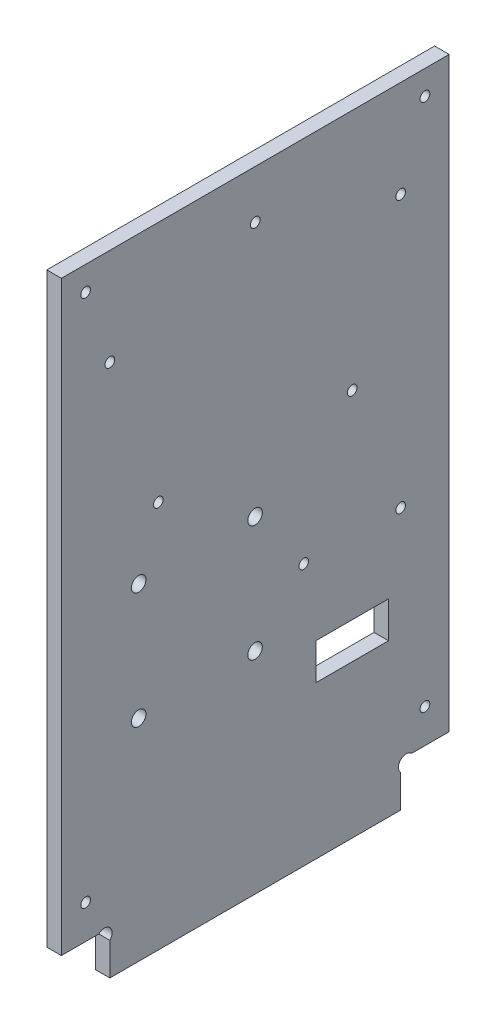
ISO-10303-21;
HEADER;
FILE_DESCRIPTION(('STEP AP214'),'2;1');
FILE_NAME('part.step','',(''),(''),'','','');
FILE_SCHEMA(('AUTOMOTIVE_DESIGN { 1 0 10303 214 1 1 1 1 }'));
ENDSEC;
DATA;
#1=APPLICATION_CONTEXT('core data for automotive mechanical design processes');
#2=APPLICATION_PROTOCOL_DEFINITION('international standard','automotive_design',2000,#1);
#3=PRODUCT_CONTEXT('',#1,'mechanical');
#4=PRODUCT('Part','Part','',(#3));
#5=PRODUCT_RELATED_PRODUCT_CATEGORY('part','',(#4));
#6=PRODUCT_DEFINITION_FORMATION('','',#4);
#7=PRODUCT_DEFINITION_CONTEXT('part definition',#1,'design');
#8=PRODUCT_DEFINITION('design','',#6,#7);
#9=PRODUCT_DEFINITION_SHAPE('','',#8);
#10=(LENGTH_UNIT() NAMED_UNIT(*) SI_UNIT(.MILLI.,.METRE.));
#11=(NAMED_UNIT(*) PLANE_ANGLE_UNIT() SI_UNIT($,.RADIAN.));
#12=(NAMED_UNIT(*) SI_UNIT($,.STERADIAN.) SOLID_ANGLE_UNIT());
#13=UNCERTAINTY_MEASURE_WITH_UNIT(LENGTH_MEASURE(1.E-05),#10,'distance_accuracy_value','');
#14=(GEOMETRIC_REPRESENTATION_CONTEXT(3) GLOBAL_UNCERTAINTY_ASSIGNED_CONTEXT((#13)) GLOBAL_UNIT_ASSIGNED_CONTEXT((#10,
#11,#12)) REPRESENTATION_CONTEXT('',''));
#15=CARTESIAN_POINT('',(0.,0.,0.));
#16=DIRECTION('',(0.,0.,1.));
#17=DIRECTION('',(1.,0.,0.));
#18=AXIS2_PLACEMENT_3D('',#15,#16,#17);
#19=CARTESIAN_POINT('',(3.,7.86862915010153,-8.86862915010152));
#20=DIRECTION('',(-1.,0.,0.));
#21=DIRECTION('',(0.,0.,1.));
#22=AXIS2_PLACEMENT_3D('',#19,#20,#21);
#23=CYLINDRICAL_SURFACE('',#22,1.6);
#24=CARTESIAN_POINT('',(0.,7.86862915010153,-8.86862915010152));
#25=DIRECTION('',(-1.,0.,0.));
#26=DIRECTION('',(0.,0.,-1.));
#27=AXIS2_PLACEMENT_3D('',#24,#25,#26);
#28=CIRCLE('',#27,1.6);
#29=CARTESIAN_POINT('',(0.,9.,-7.73725830020304));
#30=VERTEX_POINT('',#29);
#31=CARTESIAN_POINT('',(0.,6.73725830020305,-10.));
#32=VERTEX_POINT('',#31);
#33=EDGE_CURVE('E237',#30,#32,#28,.T.);
#34=ORIENTED_EDGE('',*,*,#33,.T.);
#35=DIRECTION('',(-1.,0.,0.));
#36=VECTOR('',#35,1.);
#37=CARTESIAN_POINT('',(3.,6.73725830020305,-10.));
#38=LINE('',#37,#36);
#39=CARTESIAN_POINT('',(3.,6.73725830020305,-10.));
#40=VERTEX_POINT('',#39);
#41=EDGE_CURVE('E11',#40,#32,#38,.T.);
#42=ORIENTED_EDGE('',*,*,#41,.F.);
#43=CARTESIAN_POINT('',(3.,7.86862915010153,-8.86862915010152));
#44=DIRECTION('',(-1.,0.,0.));
#45=DIRECTION('',(0.,0.,-1.));
#46=AXIS2_PLACEMENT_3D('',#43,#44,#45);
#47=CIRCLE('',#46,1.6);
#48=CARTESIAN_POINT('',(3.,9.,-7.73725830020304));
#49=VERTEX_POINT('',#48);
#50=EDGE_CURVE('E240',#49,#40,#47,.T.);
#51=ORIENTED_EDGE('',*,*,#50,.F.);
#52=DIRECTION('',(-1.,0.,0.));
#53=VECTOR('',#52,1.);
#54=CARTESIAN_POINT('',(3.,9.,-7.73725830020304));
#55=LINE('',#54,#53);
#56=EDGE_CURVE('E262',#49,#30,#55,.T.);
#57=ORIENTED_EDGE('',*,*,#56,.T.);
#58=EDGE_LOOP('',(#34,#42,#51,#57));
#59=FACE_BOUND('',#58,.T.);
#60=ADVANCED_FACE('F33',(#59),#23,.F.);
#61=CARTESIAN_POINT('',(3.,6.73725830020305,-10.));
#62=DIRECTION('',(0.,0.,-1.));
#63=DIRECTION('',(-1.,0.,0.));
#64=AXIS2_PLACEMENT_3D('',#61,#62,#63);
#65=PLANE('',#64);
#66=DIRECTION('',(0.,-1.,0.));
#67=VECTOR('',#66,1.);
#68=CARTESIAN_POINT('',(0.,6.73725830020305,-10.));
#69=LINE('',#68,#67);
#70=CARTESIAN_POINT('',(0.,0.,-10.));
#71=VERTEX_POINT('',#70);
#72=EDGE_CURVE('E265',#32,#71,#69,.T.);
#73=ORIENTED_EDGE('',*,*,#72,.T.);
#74=DIRECTION('',(-1.,0.,0.));
#75=VECTOR('',#74,1.);
#76=CARTESIAN_POINT('',(3.,0.,-10.));
#77=LINE('',#76,#75);
#78=CARTESIAN_POINT('',(3.,0.,-10.));
#79=VERTEX_POINT('',#78);
#80=EDGE_CURVE('E40',#79,#71,#77,.T.);
#81=ORIENTED_EDGE('',*,*,#80,.F.);
#82=DIRECTION('',(0.,-1.,0.));
#83=VECTOR('',#82,1.);
#84=CARTESIAN_POINT('',(3.,6.73725830020305,-10.));
#85=LINE('',#84,#83);
#86=EDGE_CURVE('E243',#40,#79,#85,.T.);
#87=ORIENTED_EDGE('',*,*,#86,.F.);
#88=ORIENTED_EDGE('',*,*,#41,.T.);
#89=EDGE_LOOP('',(#73,#81,#87,#88));
#90=FACE_BOUND('',#89,.T.);
#91=ADVANCED_FACE('F331',(#90),#65,.F.);
#92=CARTESIAN_POINT('',(3.,0.,-10.));
#93=DIRECTION('',(0.,1.,0.));
#94=DIRECTION('',(0.,0.,1.));
#95=AXIS2_PLACEMENT_3D('',#92,#93,#94);
#96=PLANE('',#95);
#97=DIRECTION('',(0.,0.,-1.));
#98=VECTOR('',#97,1.);
#99=CARTESIAN_POINT('',(0.,0.,-10.));
#100=LINE('',#99,#98);
#101=CARTESIAN_POINT('',(0.,0.,-70.));
#102=VERTEX_POINT('',#101);
#103=EDGE_CURVE('E267',#71,#102,#100,.T.);
#104=ORIENTED_EDGE('',*,*,#103,.T.);
#105=DIRECTION('',(-1.,0.,0.));
#106=VECTOR('',#105,1.);
#107=CARTESIAN_POINT('',(3.,0.,-70.));
#108=LINE('',#107,#106);
#109=CARTESIAN_POINT('',(3.,0.,-70.));
#110=VERTEX_POINT('',#109);
#111=EDGE_CURVE('E302',#110,#102,#108,.T.);
#112=ORIENTED_EDGE('',*,*,#111,.F.);
#113=DIRECTION('',(0.,0.,-1.));
#114=VECTOR('',#113,1.);
#115=CARTESIAN_POINT('',(3.,0.,-10.));
#116=LINE('',#115,#114);
#117=EDGE_CURVE('E246',#79,#110,#116,.T.);
#118=ORIENTED_EDGE('',*,*,#117,.F.);
#119=ORIENTED_EDGE('',*,*,#80,.T.);
#120=EDGE_LOOP('',(#104,#112,#118,#119));
#121=FACE_BOUND('',#120,.T.);
#122=ADVANCED_FACE('F309',(#121),#96,.F.);
#123=CARTESIAN_POINT('',(3.,6.73725830020307,-70.));
#124=DIRECTION('',(0.,0.,1.));
#125=DIRECTION('',(0.,-1.,0.));
#126=AXIS2_PLACEMENT_3D('',#123,#124,#125);
#127=PLANE('',#126);
#128=DIRECTION('',(0.,1.,0.));
#129=VECTOR('',#128,1.);
#130=CARTESIAN_POINT('',(0.,6.73725830020307,-70.));
#131=LINE('',#130,#129);
#132=CARTESIAN_POINT('',(0.,6.73725830020307,-70.));
#133=VERTEX_POINT('',#132);
#134=EDGE_CURVE('E269',#102,#133,#131,.T.);
#135=ORIENTED_EDGE('',*,*,#134,.T.);
#136=DIRECTION('',(-1.,0.,0.));
#137=VECTOR('',#136,1.);
#138=CARTESIAN_POINT('',(3.,6.73725830020307,-70.));
#139=LINE('',#138,#137);
#140=CARTESIAN_POINT('',(3.,6.73725830020307,-70.));
#141=VERTEX_POINT('',#140);
#142=EDGE_CURVE('E299',#141,#133,#139,.T.);
#143=ORIENTED_EDGE('',*,*,#142,.F.);
#144=DIRECTION('',(0.,1.,0.));
#145=VECTOR('',#144,1.);
#146=CARTESIAN_POINT('',(3.,6.73725830020307,-70.));
#147=LINE('',#146,#145);
#148=EDGE_CURVE('E248',#110,#141,#147,.T.);
#149=ORIENTED_EDGE('',*,*,#148,.F.);
#150=ORIENTED_EDGE('',*,*,#111,.T.);
#151=EDGE_LOOP('',(#135,#143,#149,#150));
#152=FACE_BOUND('',#151,.T.);
#153=ADVANCED_FACE('F320',(#152),#127,.F.);
#154=CARTESIAN_POINT('',(3.,7.86862915010154,-71.1313708498985));
#155=DIRECTION('',(-1.,0.,0.));
#156=DIRECTION('',(0.,0.,1.));
#157=AXIS2_PLACEMENT_3D('',#154,#155,#156);
#158=CYLINDRICAL_SURFACE('',#157,1.6);
#159=CARTESIAN_POINT('',(0.,7.86862915010154,-71.1313708498985));
#160=DIRECTION('',(-1.,0.,0.));
#161=DIRECTION('',(0.,0.,1.));
#162=AXIS2_PLACEMENT_3D('',#159,#160,#161);
#163=CIRCLE('',#162,1.6);
#164=CARTESIAN_POINT('',(0.,8.99999999999999,-72.262741699797));
#165=VERTEX_POINT('',#164);
#166=EDGE_CURVE('E271',#133,#165,#163,.T.);
#167=ORIENTED_EDGE('',*,*,#166,.T.);
#168=DIRECTION('',(-1.,0.,0.));
#169=VECTOR('',#168,1.);
#170=CARTESIAN_POINT('',(3.,8.99999999999999,-72.262741699797));
#171=LINE('',#170,#169);
#172=CARTESIAN_POINT('',(3.,8.99999999999999,-72.262741699797));
#173=VERTEX_POINT('',#172);
#174=EDGE_CURVE('E296',#173,#165,#171,.T.);
#175=ORIENTED_EDGE('',*,*,#174,.F.);
#176=CARTESIAN_POINT('',(3.,7.86862915010154,-71.1313708498985));
#177=DIRECTION('',(-1.,0.,0.));
#178=DIRECTION('',(0.,0.,1.));
#179=AXIS2_PLACEMENT_3D('',#176,#177,#178);
#180=CIRCLE('',#179,1.6);
#181=EDGE_CURVE('E250',#141,#173,#180,.T.);
#182=ORIENTED_EDGE('',*,*,#181,.F.);
#183=ORIENTED_EDGE('',*,*,#142,.T.);
#184=EDGE_LOOP('',(#167,#175,#182,#183));
#185=FACE_BOUND('',#184,.T.);
#186=ADVANCED_FACE('F324',(#185),#158,.F.);
#187=CARTESIAN_POINT('',(3.,8.99999999999999,-72.262741699797));
#188=DIRECTION('',(0.,1.,0.));
#189=DIRECTION('',(0.,0.,1.));
#190=AXIS2_PLACEMENT_3D('',#187,#188,#189);
#191=PLANE('',#190);
#192=DIRECTION('',(0.,0.,-1.));
#193=VECTOR('',#192,1.);
#194=CARTESIAN_POINT('',(0.,8.99999999999999,-72.262741699797));
#195=LINE('',#194,#193);
#196=CARTESIAN_POINT('',(0.,8.99999999999999,-80.));
#197=VERTEX_POINT('',#196);
#198=EDGE_CURVE('E273',#165,#197,#195,.T.);
#199=ORIENTED_EDGE('',*,*,#198,.T.);
#200=DIRECTION('',(-1.,0.,0.));
#201=VECTOR('',#200,1.);
#202=CARTESIAN_POINT('',(3.,8.99999999999999,-80.));
#203=LINE('',#202,#201);
#204=CARTESIAN_POINT('',(3.,8.99999999999999,-80.));
#205=VERTEX_POINT('',#204);
#206=EDGE_CURVE('E293',#205,#197,#203,.T.);
#207=ORIENTED_EDGE('',*,*,#206,.F.);
#208=DIRECTION('',(0.,0.,-1.));
#209=VECTOR('',#208,1.);
#210=CARTESIAN_POINT('',(3.,8.99999999999999,-72.262741699797));
#211=LINE('',#210,#209);
#212=EDGE_CURVE('E252',#173,#205,#211,.T.);
#213=ORIENTED_EDGE('',*,*,#212,.F.);
#214=ORIENTED_EDGE('',*,*,#174,.T.);
#215=EDGE_LOOP('',(#199,#207,#213,#214));
#216=FACE_BOUND('',#215,.T.);
#217=ADVANCED_FACE('F354',(#216),#191,.F.);
#218=CARTESIAN_POINT('',(3.,130.,-80.));
#219=DIRECTION('',(0.,0.,1.));
#220=DIRECTION('',(0.,-1.,0.));
#221=AXIS2_PLACEMENT_3D('',#218,#219,#220);
#222=PLANE('',#221);
#223=DIRECTION('',(0.,1.,0.));
#224=VECTOR('',#223,1.);
#225=CARTESIAN_POINT('',(0.,130.,-80.));
#226=LINE('',#225,#224);
#227=CARTESIAN_POINT('',(0.,130.,-80.));
#228=VERTEX_POINT('',#227);
#229=EDGE_CURVE('E275',#197,#228,#226,.T.);
#230=ORIENTED_EDGE('',*,*,#229,.T.);
#231=DIRECTION('',(-1.,0.,0.));
#232=VECTOR('',#231,1.);
#233=CARTESIAN_POINT('',(3.,130.,-80.));
#234=LINE('',#233,#232);
#235=CARTESIAN_POINT('',(3.,130.,-80.));
#236=VERTEX_POINT('',#235);
#237=EDGE_CURVE('E290',#236,#228,#234,.T.);
#238=ORIENTED_EDGE('',*,*,#237,.F.);
#239=DIRECTION('',(0.,1.,0.));
#240=VECTOR('',#239,1.);
#241=CARTESIAN_POINT('',(3.,130.,-80.));
#242=LINE('',#241,#240);
#243=EDGE_CURVE('E254',#205,#236,#242,.T.);
#244=ORIENTED_EDGE('',*,*,#243,.F.);
#245=ORIENTED_EDGE('',*,*,#206,.T.);
#246=EDGE_LOOP('',(#230,#238,#244,#245));
#247=FACE_BOUND('',#246,.T.);
#248=ADVANCED_FACE('F351',(#247),#222,.F.);
#249=CARTESIAN_POINT('',(3.,130.,0.));
#250=DIRECTION('',(0.,-1.,0.));
#251=DIRECTION('',(0.,0.,-1.));
#252=AXIS2_PLACEMENT_3D('',#249,#250,#251);
#253=PLANE('',#252);
#254=DIRECTION('',(0.,0.,1.));
#255=VECTOR('',#254,1.);
#256=CARTESIAN_POINT('',(0.,130.,0.));
#257=LINE('',#256,#255);
#258=CARTESIAN_POINT('',(0.,130.,0.));
#259=VERTEX_POINT('',#258);
#260=EDGE_CURVE('E277',#228,#259,#257,.T.);
#261=ORIENTED_EDGE('',*,*,#260,.T.);
#262=DIRECTION('',(-1.,0.,0.));
#263=VECTOR('',#262,1.);
#264=CARTESIAN_POINT('',(3.,130.,0.));
#265=LINE('',#264,#263);
#266=CARTESIAN_POINT('',(3.,130.,0.));
#267=VERTEX_POINT('',#266);
#268=EDGE_CURVE('E287',#267,#259,#265,.T.);
#269=ORIENTED_EDGE('',*,*,#268,.F.);
#270=DIRECTION('',(0.,0.,1.));
#271=VECTOR('',#270,1.);
#272=CARTESIAN_POINT('',(3.,130.,0.));
#273=LINE('',#272,#271);
#274=EDGE_CURVE('E256',#236,#267,#273,.T.);
#275=ORIENTED_EDGE('',*,*,#274,.F.);
#276=ORIENTED_EDGE('',*,*,#237,.T.);
#277=EDGE_LOOP('',(#261,#269,#275,#276));
#278=FACE_BOUND('',#277,.T.);
#279=ADVANCED_FACE('F347',(#278),#253,.F.);
#280=CARTESIAN_POINT('',(3.,9.,0.));
#281=DIRECTION('',(0.,0.,-1.));
#282=DIRECTION('',(-1.,0.,0.));
#283=AXIS2_PLACEMENT_3D('',#280,#281,#282);
#284=PLANE('',#283);
#285=DIRECTION('',(0.,-1.,0.));
#286=VECTOR('',#285,1.);
#287=CARTESIAN_POINT('',(0.,9.,0.));
#288=LINE('',#287,#286);
#289=CARTESIAN_POINT('',(0.,9.,0.));
#290=VERTEX_POINT('',#289);
#291=EDGE_CURVE('E279',#259,#290,#288,.T.);
#292=ORIENTED_EDGE('',*,*,#291,.T.);
#293=DIRECTION('',(-1.,0.,0.));
#294=VECTOR('',#293,1.);
#295=CARTESIAN_POINT('',(3.,9.,0.));
#296=LINE('',#295,#294);
#297=CARTESIAN_POINT('',(3.,9.,0.));
#298=VERTEX_POINT('',#297);
#299=EDGE_CURVE('E284',#298,#290,#296,.T.);
#300=ORIENTED_EDGE('',*,*,#299,.F.);
#301=DIRECTION('',(0.,-1.,0.));
#302=VECTOR('',#301,1.);
#303=CARTESIAN_POINT('',(3.,9.,0.));
#304=LINE('',#303,#302);
#305=EDGE_CURVE('E258',#267,#298,#304,.T.);
#306=ORIENTED_EDGE('',*,*,#305,.F.);
#307=ORIENTED_EDGE('',*,*,#268,.T.);
#308=EDGE_LOOP('',(#292,#300,#306,#307));
#309=FACE_BOUND('',#308,.T.);
#310=ADVANCED_FACE('F343',(#309),#284,.F.);
#311=CARTESIAN_POINT('',(3.,9.,-7.73725830020304));
#312=DIRECTION('',(0.,1.,0.));
#313=DIRECTION('',(0.,0.,1.));
#314=AXIS2_PLACEMENT_3D('',#311,#312,#313);
#315=PLANE('',#314);
#316=DIRECTION('',(0.,0.,-1.));
#317=VECTOR('',#316,1.);
#318=CARTESIAN_POINT('',(0.,9.,-7.73725830020304));
#319=LINE('',#318,#317);
#320=EDGE_CURVE('E244',#290,#30,#319,.T.);
#321=ORIENTED_EDGE('',*,*,#320,.T.);
#322=ORIENTED_EDGE('',*,*,#56,.F.);
#323=DIRECTION('',(0.,0.,-1.));
#324=VECTOR('',#323,1.);
#325=CARTESIAN_POINT('',(3.,9.,-7.73725830020304));
#326=LINE('',#325,#324);
#327=EDGE_CURVE('E260',#298,#49,#326,.T.);
#328=ORIENTED_EDGE('',*,*,#327,.F.);
#329=ORIENTED_EDGE('',*,*,#299,.T.);
#330=EDGE_LOOP('',(#321,#322,#328,#329));
#331=FACE_BOUND('',#330,.T.);
#332=ADVANCED_FACE('F338',(#331),#315,.F.);
#333=CARTESIAN_POINT('',(3.,7.86862915010153,-8.86862915010152));
#334=DIRECTION('',(1.,0.,0.));
#335=DIRECTION('',(0.,0.,-1.));
#336=AXIS2_PLACEMENT_3D('',#333,#334,#335);
#337=PLANE('',#336);
#338=CARTESIAN_POINT('',(3.,16.,-5.));
#339=DIRECTION('',(1.,0.,0.));
#340=DIRECTION('',(0.,0.,-1.));
#341=AXIS2_PLACEMENT_3D('',#338,#339,#340);
#342=CIRCLE('',#341,1.);
#343=CARTESIAN_POINT('',(3.,16.,-6.));
#344=VERTEX_POINT('',#343);
#345=EDGE_CURVE('E628',#344,#344,#342,.T.);
#346=ORIENTED_EDGE('',*,*,#345,.F.);
#347=EDGE_LOOP('',(#346));
#348=FACE_BOUND('',#347,.T.);
#349=CARTESIAN_POINT('',(3.,16.,-75.));
#350=DIRECTION('',(1.,0.,0.));
#351=DIRECTION('',(0.,0.,-1.));
#352=AXIS2_PLACEMENT_3D('',#349,#350,#351);
#353=CIRCLE('',#352,0.999999999999998);
#354=CARTESIAN_POINT('',(3.,16.,-76.));
#355=VERTEX_POINT('',#354);
#356=EDGE_CURVE('E630',#355,#355,#353,.T.);
#357=ORIENTED_EDGE('',*,*,#356,.F.);
#358=EDGE_LOOP('',(#357));
#359=FACE_BOUND('',#358,.T.);
#360=CARTESIAN_POINT('',(3.,125.,-75.));
#361=DIRECTION('',(1.,0.,0.));
#362=DIRECTION('',(0.,0.,-1.));
#363=AXIS2_PLACEMENT_3D('',#360,#361,#362);
#364=CIRCLE('',#363,0.999999999999998);
#365=CARTESIAN_POINT('',(3.,125.,-76.));
#366=VERTEX_POINT('',#365);
#367=EDGE_CURVE('E641',#366,#366,#364,.T.);
#368=ORIENTED_EDGE('',*,*,#367,.F.);
#369=EDGE_LOOP('',(#368));
#370=FACE_BOUND('',#369,.T.);
#371=CARTESIAN_POINT('',(3.,125.,-5.));
#372=DIRECTION('',(1.,0.,0.));
#373=DIRECTION('',(0.,0.,-1.));
#374=AXIS2_PLACEMENT_3D('',#371,#372,#373);
#375=CIRCLE('',#374,1.);
#376=CARTESIAN_POINT('',(3.,125.,-6.));
#377=VERTEX_POINT('',#376);
#378=EDGE_CURVE('E157',#377,#377,#375,.T.);
#379=ORIENTED_EDGE('',*,*,#378,.F.);
#380=EDGE_LOOP('',(#379));
#381=FACE_BOUND('',#380,.T.);
#382=DIRECTION('',(0.,-1.,0.));
#383=VECTOR('',#382,1.);
#384=CARTESIAN_POINT('',(3.,39.,-67.5));
#385=LINE('',#384,#383);
#386=CARTESIAN_POINT('',(3.,39.,-67.5));
#387=VERTEX_POINT('',#386);
#388=CARTESIAN_POINT('',(3.,31.5,-67.5));
#389=VERTEX_POINT('',#388);
#390=EDGE_CURVE('E135',#387,#389,#385,.T.);
#391=ORIENTED_EDGE('',*,*,#390,.T.);
#392=DIRECTION('',(0.,0.,1.));
#393=VECTOR('',#392,1.);
#394=CARTESIAN_POINT('',(3.,31.5,-67.5));
#395=LINE('',#394,#393);
#396=CARTESIAN_POINT('',(3.,31.5,-52.5));
#397=VERTEX_POINT('',#396);
#398=EDGE_CURVE('E144',#389,#397,#395,.T.);
#399=ORIENTED_EDGE('',*,*,#398,.T.);
#400=DIRECTION('',(0.,1.,0.));
#401=VECTOR('',#400,1.);
#402=CARTESIAN_POINT('',(3.,39.,-52.5));
#403=LINE('',#402,#401);
#404=CARTESIAN_POINT('',(3.,39.,-52.5));
#405=VERTEX_POINT('',#404);
#406=EDGE_CURVE('E47',#397,#405,#403,.T.);
#407=ORIENTED_EDGE('',*,*,#406,.T.);
#408=DIRECTION('',(0.,0.,-1.));
#409=VECTOR('',#408,1.);
#410=CARTESIAN_POINT('',(3.,39.,-67.5));
#411=LINE('',#410,#409);
#412=EDGE_CURVE('E141',#405,#387,#411,.T.);
#413=ORIENTED_EDGE('',*,*,#412,.T.);
#414=EDGE_LOOP('',(#391,#399,#407,#413));
#415=FACE_BOUND('',#414,.T.);
#416=CARTESIAN_POINT('',(3.,67.45,-39.95));
#417=DIRECTION('',(1.,0.,0.));
#418=DIRECTION('',(0.,0.,-1.));
#419=AXIS2_PLACEMENT_3D('',#416,#417,#418);
#420=CIRCLE('',#419,1.5);
#421=CARTESIAN_POINT('',(3.,67.45,-41.45));
#422=VERTEX_POINT('',#421);
#423=EDGE_CURVE('E170',#422,#422,#420,.T.);
#424=ORIENTED_EDGE('',*,*,#423,.F.);
#425=EDGE_LOOP('',(#424));
#426=FACE_BOUND('',#425,.T.);
#427=CARTESIAN_POINT('',(3.,43.45,-39.95));
#428=DIRECTION('',(1.,0.,0.));
#429=DIRECTION('',(0.,0.,-1.));
#430=AXIS2_PLACEMENT_3D('',#427,#428,#429);
#431=CIRCLE('',#430,1.5);
#432=CARTESIAN_POINT('',(3.,43.45,-41.45));
#433=VERTEX_POINT('',#432);
#434=EDGE_CURVE('E177',#433,#433,#431,.T.);
#435=ORIENTED_EDGE('',*,*,#434,.F.);
#436=EDGE_LOOP('',(#435));
#437=FACE_BOUND('',#436,.T.);
#438=CARTESIAN_POINT('',(3.,43.45,-15.95));
#439=DIRECTION('',(1.,0.,0.));
#440=DIRECTION('',(0.,0.,-1.));
#441=AXIS2_PLACEMENT_3D('',#438,#439,#440);
#442=CIRCLE('',#441,1.5);
#443=CARTESIAN_POINT('',(3.,43.45,-17.45));
#444=VERTEX_POINT('',#443);
#445=EDGE_CURVE('E183',#444,#444,#442,.T.);
#446=ORIENTED_EDGE('',*,*,#445,.F.);
#447=EDGE_LOOP('',(#446));
#448=FACE_BOUND('',#447,.T.);
#449=CARTESIAN_POINT('',(3.,67.45,-15.95));
#450=DIRECTION('',(1.,0.,0.));
#451=DIRECTION('',(0.,0.,-1.));
#452=AXIS2_PLACEMENT_3D('',#449,#450,#451);
#453=CIRCLE('',#452,1.5);
#454=CARTESIAN_POINT('',(3.,67.45,-17.45));
#455=VERTEX_POINT('',#454);
#456=EDGE_CURVE('E189',#455,#455,#453,.T.);
#457=ORIENTED_EDGE('',*,*,#456,.F.);
#458=EDGE_LOOP('',(#457));
#459=FACE_BOUND('',#458,.T.);
#460=CARTESIAN_POINT('',(3.,120.,-40.));
#461=DIRECTION('',(1.,0.,0.));
#462=DIRECTION('',(0.,0.,-1.));
#463=AXIS2_PLACEMENT_3D('',#460,#461,#462);
#464=CIRCLE('',#463,0.999999999999998);
#465=CARTESIAN_POINT('',(3.,120.,-41.));
#466=VERTEX_POINT('',#465);
#467=EDGE_CURVE('E195',#466,#466,#464,.T.);
#468=ORIENTED_EDGE('',*,*,#467,.F.);
#469=EDGE_LOOP('',(#468));
#470=FACE_BOUND('',#469,.T.);
#471=CARTESIAN_POINT('',(3.,80.,-20.));
#472=DIRECTION('',(1.,0.,0.));
#473=DIRECTION('',(0.,0.,1.));
#474=AXIS2_PLACEMENT_3D('',#471,#472,#473);
#475=CIRCLE('',#474,1.);
#476=CARTESIAN_POINT('',(3.,80.,-19.));
#477=VERTEX_POINT('',#476);
#478=EDGE_CURVE('E201',#477,#477,#475,.T.);
#479=ORIENTED_EDGE('',*,*,#478,.F.);
#480=EDGE_LOOP('',(#479));
#481=FACE_BOUND('',#480,.T.);
#482=CARTESIAN_POINT('',(3.,54.,-70.));
#483=DIRECTION('',(1.,0.,0.));
#484=DIRECTION('',(0.,0.,-1.));
#485=AXIS2_PLACEMENT_3D('',#482,#483,#484);
#486=CIRCLE('',#485,0.999999999999998);
#487=CARTESIAN_POINT('',(3.,54.,-71.));
#488=VERTEX_POINT('',#487);
#489=EDGE_CURVE('E207',#488,#488,#486,.T.);
#490=ORIENTED_EDGE('',*,*,#489,.F.);
#491=EDGE_LOOP('',(#490));
#492=FACE_BOUND('',#491,.T.);
#493=CARTESIAN_POINT('',(3.,54.,-50.));
#494=DIRECTION('',(1.,0.,0.));
#495=DIRECTION('',(0.,0.,-1.));
#496=AXIS2_PLACEMENT_3D('',#493,#494,#495);
#497=CIRCLE('',#496,0.999999999999998);
#498=CARTESIAN_POINT('',(3.,54.,-51.));
#499=VERTEX_POINT('',#498);
#500=EDGE_CURVE('E213',#499,#499,#497,.T.);
#501=ORIENTED_EDGE('',*,*,#500,.F.);
#502=EDGE_LOOP('',(#501));
#503=FACE_BOUND('',#502,.T.);
#504=CARTESIAN_POINT('',(3.,110.,-70.));
#505=DIRECTION('',(1.,0.,0.));
#506=DIRECTION('',(0.,0.,-1.));
#507=AXIS2_PLACEMENT_3D('',#504,#505,#506);
#508=CIRCLE('',#507,0.999999999999998);
#509=CARTESIAN_POINT('',(3.,110.,-71.));
#510=VERTEX_POINT('',#509);
#511=EDGE_CURVE('E219',#510,#510,#508,.T.);
#512=ORIENTED_EDGE('',*,*,#511,.F.);
#513=EDGE_LOOP('',(#512));
#514=FACE_BOUND('',#513,.T.);
#515=CARTESIAN_POINT('',(3.,80.,-60.));
#516=DIRECTION('',(1.,0.,0.));
#517=DIRECTION('',(0.,0.,-1.));
#518=AXIS2_PLACEMENT_3D('',#515,#516,#517);
#519=CIRCLE('',#518,0.999999999999998);
#520=CARTESIAN_POINT('',(3.,80.,-61.));
#521=VERTEX_POINT('',#520);
#522=EDGE_CURVE('E225',#521,#521,#519,.T.);
#523=ORIENTED_EDGE('',*,*,#522,.F.);
#524=EDGE_LOOP('',(#523));
#525=FACE_BOUND('',#524,.T.);
#526=CARTESIAN_POINT('',(3.,110.,-10.));
#527=DIRECTION('',(1.,0.,0.));
#528=DIRECTION('',(0.,0.,-1.));
#529=AXIS2_PLACEMENT_3D('',#526,#527,#528);
#530=CIRCLE('',#529,1.);
#531=CARTESIAN_POINT('',(3.,110.,-11.));
#532=VERTEX_POINT('',#531);
#533=EDGE_CURVE('E231',#532,#532,#530,.T.);
#534=ORIENTED_EDGE('',*,*,#533,.F.);
#535=EDGE_LOOP('',(#534));
#536=FACE_BOUND('',#535,.T.);
#537=ORIENTED_EDGE('',*,*,#50,.T.);
#538=ORIENTED_EDGE('',*,*,#86,.T.);
#539=ORIENTED_EDGE('',*,*,#117,.T.);
#540=ORIENTED_EDGE('',*,*,#148,.T.);
#541=ORIENTED_EDGE('',*,*,#181,.T.);
#542=ORIENTED_EDGE('',*,*,#212,.T.);
#543=ORIENTED_EDGE('',*,*,#243,.T.);
#544=ORIENTED_EDGE('',*,*,#274,.T.);
#545=ORIENTED_EDGE('',*,*,#305,.T.);
#546=ORIENTED_EDGE('',*,*,#327,.T.);
#547=EDGE_LOOP('',(#537,#538,#539,#540,#541,#542,#543,#544,#545,#546));
#548=FACE_BOUND('',#547,.T.);
#549=ADVANCED_FACE('F148',(#348,#359,#370,#381,#415,#426,#437,#448,#459,#470,#481,#492,#503,
#514,#525,#536,#548),#337,.T.);
#550=CARTESIAN_POINT('',(0.,7.86862915010153,-8.86862915010152));
#551=DIRECTION('',(1.,0.,0.));
#552=DIRECTION('',(0.,0.,-1.));
#553=AXIS2_PLACEMENT_3D('',#550,#551,#552);
#554=PLANE('',#553);
#555=CARTESIAN_POINT('',(0.,16.,-5.));
#556=DIRECTION('',(1.,0.,0.));
#557=DIRECTION('',(0.,0.,-1.));
#558=AXIS2_PLACEMENT_3D('',#555,#556,#557);
#559=CIRCLE('',#558,1.);
#560=CARTESIAN_POINT('',(0.,16.,-6.));
#561=VERTEX_POINT('',#560);
#562=EDGE_CURVE('E625',#561,#561,#559,.T.);
#563=ORIENTED_EDGE('',*,*,#562,.T.);
#564=EDGE_LOOP('',(#563));
#565=FACE_BOUND('',#564,.T.);
#566=CARTESIAN_POINT('',(0.,16.,-75.));
#567=DIRECTION('',(1.,0.,0.));
#568=DIRECTION('',(0.,0.,-1.));
#569=AXIS2_PLACEMENT_3D('',#566,#567,#568);
#570=CIRCLE('',#569,0.999999999999998);
#571=CARTESIAN_POINT('',(0.,16.,-76.));
#572=VERTEX_POINT('',#571);
#573=EDGE_CURVE('E646',#572,#572,#570,.T.);
#574=ORIENTED_EDGE('',*,*,#573,.T.);
#575=EDGE_LOOP('',(#574));
#576=FACE_BOUND('',#575,.T.);
#577=CARTESIAN_POINT('',(0.,125.,-75.));
#578=DIRECTION('',(1.,0.,0.));
#579=DIRECTION('',(0.,0.,-1.));
#580=AXIS2_PLACEMENT_3D('',#577,#578,#579);
#581=CIRCLE('',#580,0.999999999999998);
#582=CARTESIAN_POINT('',(0.,125.,-76.));
#583=VERTEX_POINT('',#582);
#584=EDGE_CURVE('E637',#583,#583,#581,.T.);
#585=ORIENTED_EDGE('',*,*,#584,.T.);
#586=EDGE_LOOP('',(#585));
#587=FACE_BOUND('',#586,.T.);
#588=CARTESIAN_POINT('',(0.,125.,-5.));
#589=DIRECTION('',(1.,0.,0.));
#590=DIRECTION('',(0.,0.,-1.));
#591=AXIS2_PLACEMENT_3D('',#588,#589,#590);
#592=CIRCLE('',#591,1.);
#593=CARTESIAN_POINT('',(0.,125.,-6.));
#594=VERTEX_POINT('',#593);
#595=EDGE_CURVE('E164',#594,#594,#592,.T.);
#596=ORIENTED_EDGE('',*,*,#595,.T.);
#597=EDGE_LOOP('',(#596));
#598=FACE_BOUND('',#597,.T.);
#599=DIRECTION('',(0.,0.,1.));
#600=VECTOR('',#599,1.);
#601=CARTESIAN_POINT('',(0.,31.5,-67.5));
#602=LINE('',#601,#600);
#603=CARTESIAN_POINT('',(0.,31.5,-67.5));
#604=VERTEX_POINT('',#603);
#605=CARTESIAN_POINT('',(0.,31.5,-52.5));
#606=VERTEX_POINT('',#605);
#607=EDGE_CURVE('E163',#604,#606,#602,.T.);
#608=ORIENTED_EDGE('',*,*,#607,.F.);
#609=DIRECTION('',(0.,-1.,0.));
#610=VECTOR('',#609,1.);
#611=CARTESIAN_POINT('',(0.,39.,-67.5));
#612=LINE('',#611,#610);
#613=CARTESIAN_POINT('',(0.,39.,-67.5));
#614=VERTEX_POINT('',#613);
#615=EDGE_CURVE('E55',#614,#604,#612,.T.);
#616=ORIENTED_EDGE('',*,*,#615,.F.);
#617=DIRECTION('',(0.,0.,-1.));
#618=VECTOR('',#617,1.);
#619=CARTESIAN_POINT('',(0.,39.,-67.5));
#620=LINE('',#619,#618);
#621=CARTESIAN_POINT('',(0.,39.,-52.5));
#622=VERTEX_POINT('',#621);
#623=EDGE_CURVE('E151',#622,#614,#620,.T.);
#624=ORIENTED_EDGE('',*,*,#623,.F.);
#625=DIRECTION('',(0.,1.,0.));
#626=VECTOR('',#625,1.);
#627=CARTESIAN_POINT('',(0.,39.,-52.5));
#628=LINE('',#627,#626);
#629=EDGE_CURVE('E154',#606,#622,#628,.T.);
#630=ORIENTED_EDGE('',*,*,#629,.F.);
#631=EDGE_LOOP('',(#608,#616,#624,#630));
#632=FACE_BOUND('',#631,.T.);
#633=CARTESIAN_POINT('',(0.,67.45,-39.95));
#634=DIRECTION('',(1.,0.,0.));
#635=DIRECTION('',(0.,0.,-1.));
#636=AXIS2_PLACEMENT_3D('',#633,#634,#635);
#637=CIRCLE('',#636,1.5);
#638=CARTESIAN_POINT('',(0.,67.45,-41.45));
#639=VERTEX_POINT('',#638);
#640=EDGE_CURVE('E174',#639,#639,#637,.T.);
#641=ORIENTED_EDGE('',*,*,#640,.T.);
#642=EDGE_LOOP('',(#641));
#643=FACE_BOUND('',#642,.T.);
#644=CARTESIAN_POINT('',(0.,43.45,-39.95));
#645=DIRECTION('',(1.,0.,0.));
#646=DIRECTION('',(0.,0.,-1.));
#647=AXIS2_PLACEMENT_3D('',#644,#645,#646);
#648=CIRCLE('',#647,1.5);
#649=CARTESIAN_POINT('',(0.,43.45,-41.45));
#650=VERTEX_POINT('',#649);
#651=EDGE_CURVE('E180',#650,#650,#648,.T.);
#652=ORIENTED_EDGE('',*,*,#651,.T.);
#653=EDGE_LOOP('',(#652));
#654=FACE_BOUND('',#653,.T.);
#655=CARTESIAN_POINT('',(0.,43.45,-15.95));
#656=DIRECTION('',(1.,0.,0.));
#657=DIRECTION('',(0.,0.,-1.));
#658=AXIS2_PLACEMENT_3D('',#655,#656,#657);
#659=CIRCLE('',#658,1.5);
#660=CARTESIAN_POINT('',(0.,43.45,-17.45));
#661=VERTEX_POINT('',#660);
#662=EDGE_CURVE('E186',#661,#661,#659,.T.);
#663=ORIENTED_EDGE('',*,*,#662,.T.);
#664=EDGE_LOOP('',(#663));
#665=FACE_BOUND('',#664,.T.);
#666=CARTESIAN_POINT('',(0.,67.45,-15.95));
#667=DIRECTION('',(1.,0.,0.));
#668=DIRECTION('',(0.,0.,-1.));
#669=AXIS2_PLACEMENT_3D('',#666,#667,#668);
#670=CIRCLE('',#669,1.5);
#671=CARTESIAN_POINT('',(0.,67.45,-17.45));
#672=VERTEX_POINT('',#671);
#673=EDGE_CURVE('E192',#672,#672,#670,.T.);
#674=ORIENTED_EDGE('',*,*,#673,.T.);
#675=EDGE_LOOP('',(#674));
#676=FACE_BOUND('',#675,.T.);
#677=CARTESIAN_POINT('',(0.,120.,-40.));
#678=DIRECTION('',(1.,0.,0.));
#679=DIRECTION('',(0.,0.,-1.));
#680=AXIS2_PLACEMENT_3D('',#677,#678,#679);
#681=CIRCLE('',#680,0.999999999999998);
#682=CARTESIAN_POINT('',(0.,120.,-41.));
#683=VERTEX_POINT('',#682);
#684=EDGE_CURVE('E198',#683,#683,#681,.T.);
#685=ORIENTED_EDGE('',*,*,#684,.T.);
#686=EDGE_LOOP('',(#685));
#687=FACE_BOUND('',#686,.T.);
#688=CARTESIAN_POINT('',(0.,80.,-20.));
#689=DIRECTION('',(1.,0.,0.));
#690=DIRECTION('',(0.,0.,1.));
#691=AXIS2_PLACEMENT_3D('',#688,#689,#690);
#692=CIRCLE('',#691,1.);
#693=CARTESIAN_POINT('',(0.,80.,-19.));
#694=VERTEX_POINT('',#693);
#695=EDGE_CURVE('E204',#694,#694,#692,.T.);
#696=ORIENTED_EDGE('',*,*,#695,.T.);
#697=EDGE_LOOP('',(#696));
#698=FACE_BOUND('',#697,.T.);
#699=CARTESIAN_POINT('',(0.,54.,-70.));
#700=DIRECTION('',(1.,0.,0.));
#701=DIRECTION('',(0.,0.,-1.));
#702=AXIS2_PLACEMENT_3D('',#699,#700,#701);
#703=CIRCLE('',#702,0.999999999999998);
#704=CARTESIAN_POINT('',(0.,54.,-71.));
#705=VERTEX_POINT('',#704);
#706=EDGE_CURVE('E210',#705,#705,#703,.T.);
#707=ORIENTED_EDGE('',*,*,#706,.T.);
#708=EDGE_LOOP('',(#707));
#709=FACE_BOUND('',#708,.T.);
#710=CARTESIAN_POINT('',(0.,54.,-50.));
#711=DIRECTION('',(1.,0.,0.));
#712=DIRECTION('',(0.,0.,-1.));
#713=AXIS2_PLACEMENT_3D('',#710,#711,#712);
#714=CIRCLE('',#713,0.999999999999998);
#715=CARTESIAN_POINT('',(0.,54.,-51.));
#716=VERTEX_POINT('',#715);
#717=EDGE_CURVE('E216',#716,#716,#714,.T.);
#718=ORIENTED_EDGE('',*,*,#717,.T.);
#719=EDGE_LOOP('',(#718));
#720=FACE_BOUND('',#719,.T.);
#721=CARTESIAN_POINT('',(0.,110.,-70.));
#722=DIRECTION('',(1.,0.,0.));
#723=DIRECTION('',(0.,0.,-1.));
#724=AXIS2_PLACEMENT_3D('',#721,#722,#723);
#725=CIRCLE('',#724,0.999999999999998);
#726=CARTESIAN_POINT('',(0.,110.,-71.));
#727=VERTEX_POINT('',#726);
#728=EDGE_CURVE('E222',#727,#727,#725,.T.);
#729=ORIENTED_EDGE('',*,*,#728,.T.);
#730=EDGE_LOOP('',(#729));
#731=FACE_BOUND('',#730,.T.);
#732=CARTESIAN_POINT('',(0.,80.,-60.));
#733=DIRECTION('',(1.,0.,0.));
#734=DIRECTION('',(0.,0.,-1.));
#735=AXIS2_PLACEMENT_3D('',#732,#733,#734);
#736=CIRCLE('',#735,0.999999999999998);
#737=CARTESIAN_POINT('',(0.,80.,-61.));
#738=VERTEX_POINT('',#737);
#739=EDGE_CURVE('E228',#738,#738,#736,.T.);
#740=ORIENTED_EDGE('',*,*,#739,.T.);
#741=EDGE_LOOP('',(#740));
#742=FACE_BOUND('',#741,.T.);
#743=CARTESIAN_POINT('',(0.,110.,-10.));
#744=DIRECTION('',(1.,0.,0.));
#745=DIRECTION('',(0.,0.,-1.));
#746=AXIS2_PLACEMENT_3D('',#743,#744,#745);
#747=CIRCLE('',#746,1.);
#748=CARTESIAN_POINT('',(0.,110.,-11.));
#749=VERTEX_POINT('',#748);
#750=EDGE_CURVE('E234',#749,#749,#747,.T.);
#751=ORIENTED_EDGE('',*,*,#750,.T.);
#752=EDGE_LOOP('',(#751));
#753=FACE_BOUND('',#752,.T.);
#754=ORIENTED_EDGE('',*,*,#33,.F.);
#755=ORIENTED_EDGE('',*,*,#320,.F.);
#756=ORIENTED_EDGE('',*,*,#291,.F.);
#757=ORIENTED_EDGE('',*,*,#260,.F.);
#758=ORIENTED_EDGE('',*,*,#229,.F.);
#759=ORIENTED_EDGE('',*,*,#198,.F.);
#760=ORIENTED_EDGE('',*,*,#166,.F.);
#761=ORIENTED_EDGE('',*,*,#134,.F.);
#762=ORIENTED_EDGE('',*,*,#103,.F.);
#763=ORIENTED_EDGE('',*,*,#72,.F.);
#764=EDGE_LOOP('',(#754,#755,#756,#757,#758,#759,#760,#761,#762,#763));
#765=FACE_BOUND('',#764,.T.);
#766=ADVANCED_FACE('F315',(#565,#576,#587,#598,#632,#643,#654,#665,#676,#687,#698,#709,#720,
#731,#742,#753,#765),#554,.F.);
#767=CARTESIAN_POINT('',(0.,110.,-10.));
#768=DIRECTION('',(1.,0.,0.));
#769=DIRECTION('',(0.,0.,-1.));
#770=AXIS2_PLACEMENT_3D('',#767,#768,#769);
#771=CYLINDRICAL_SURFACE('',#770,1.);
#772=ORIENTED_EDGE('',*,*,#750,.F.);
#773=EDGE_LOOP('',(#772));
#774=FACE_BOUND('',#773,.T.);
#775=ORIENTED_EDGE('',*,*,#533,.T.);
#776=EDGE_LOOP('',(#775));
#777=FACE_BOUND('',#776,.T.);
#778=ADVANCED_FACE('F422',(#774,#777),#771,.F.);
#779=CARTESIAN_POINT('',(0.,80.,-60.));
#780=DIRECTION('',(1.,0.,0.));
#781=DIRECTION('',(0.,0.,-1.));
#782=AXIS2_PLACEMENT_3D('',#779,#780,#781);
#783=CYLINDRICAL_SURFACE('',#782,0.999999999999998);
#784=ORIENTED_EDGE('',*,*,#739,.F.);
#785=EDGE_LOOP('',(#784));
#786=FACE_BOUND('',#785,.T.);
#787=ORIENTED_EDGE('',*,*,#522,.T.);
#788=EDGE_LOOP('',(#787));
#789=FACE_BOUND('',#788,.T.);
#790=ADVANCED_FACE('F427',(#786,#789),#783,.F.);
#791=CARTESIAN_POINT('',(0.,110.,-70.));
#792=DIRECTION('',(1.,0.,0.));
#793=DIRECTION('',(0.,0.,-1.));
#794=AXIS2_PLACEMENT_3D('',#791,#792,#793);
#795=CYLINDRICAL_SURFACE('',#794,0.999999999999998);
#796=ORIENTED_EDGE('',*,*,#728,.F.);
#797=EDGE_LOOP('',(#796));
#798=FACE_BOUND('',#797,.T.);
#799=ORIENTED_EDGE('',*,*,#511,.T.);
#800=EDGE_LOOP('',(#799));
#801=FACE_BOUND('',#800,.T.);
#802=ADVANCED_FACE('F439',(#798,#801),#795,.F.);
#803=CARTESIAN_POINT('',(0.,54.,-50.));
#804=DIRECTION('',(1.,0.,0.));
#805=DIRECTION('',(0.,0.,-1.));
#806=AXIS2_PLACEMENT_3D('',#803,#804,#805);
#807=CYLINDRICAL_SURFACE('',#806,0.999999999999998);
#808=ORIENTED_EDGE('',*,*,#717,.F.);
#809=EDGE_LOOP('',(#808));
#810=FACE_BOUND('',#809,.T.);
#811=ORIENTED_EDGE('',*,*,#500,.T.);
#812=EDGE_LOOP('',(#811));
#813=FACE_BOUND('',#812,.T.);
#814=ADVANCED_FACE('F449',(#810,#813),#807,.F.);
#815=CARTESIAN_POINT('',(0.,54.,-70.));
#816=DIRECTION('',(1.,0.,0.));
#817=DIRECTION('',(0.,0.,-1.));
#818=AXIS2_PLACEMENT_3D('',#815,#816,#817);
#819=CYLINDRICAL_SURFACE('',#818,0.999999999999998);
#820=ORIENTED_EDGE('',*,*,#706,.F.);
#821=EDGE_LOOP('',(#820));
#822=FACE_BOUND('',#821,.T.);
#823=ORIENTED_EDGE('',*,*,#489,.T.);
#824=EDGE_LOOP('',(#823));
#825=FACE_BOUND('',#824,.T.);
#826=ADVANCED_FACE('F459',(#822,#825),#819,.F.);
#827=CARTESIAN_POINT('',(0.,80.,-20.));
#828=DIRECTION('',(1.,0.,0.));
#829=DIRECTION('',(0.,0.,-1.));
#830=AXIS2_PLACEMENT_3D('',#827,#828,#829);
#831=CYLINDRICAL_SURFACE('',#830,1.);
#832=ORIENTED_EDGE('',*,*,#695,.F.);
#833=EDGE_LOOP('',(#832));
#834=FACE_BOUND('',#833,.T.);
#835=ORIENTED_EDGE('',*,*,#478,.T.);
#836=EDGE_LOOP('',(#835));
#837=FACE_BOUND('',#836,.T.);
#838=ADVANCED_FACE('F469',(#834,#837),#831,.F.);
#839=CARTESIAN_POINT('',(0.,120.,-40.));
#840=DIRECTION('',(1.,0.,0.));
#841=DIRECTION('',(0.,0.,-1.));
#842=AXIS2_PLACEMENT_3D('',#839,#840,#841);
#843=CYLINDRICAL_SURFACE('',#842,0.999999999999998);
#844=ORIENTED_EDGE('',*,*,#684,.F.);
#845=EDGE_LOOP('',(#844));
#846=FACE_BOUND('',#845,.T.);
#847=ORIENTED_EDGE('',*,*,#467,.T.);
#848=EDGE_LOOP('',(#847));
#849=FACE_BOUND('',#848,.T.);
#850=ADVANCED_FACE('F479',(#846,#849),#843,.F.);
#851=CARTESIAN_POINT('',(0.,67.45,-15.95));
#852=DIRECTION('',(1.,0.,0.));
#853=DIRECTION('',(0.,0.,-1.));
#854=AXIS2_PLACEMENT_3D('',#851,#852,#853);
#855=CYLINDRICAL_SURFACE('',#854,1.5);
#856=ORIENTED_EDGE('',*,*,#673,.F.);
#857=EDGE_LOOP('',(#856));
#858=FACE_BOUND('',#857,.T.);
#859=ORIENTED_EDGE('',*,*,#456,.T.);
#860=EDGE_LOOP('',(#859));
#861=FACE_BOUND('',#860,.T.);
#862=ADVANCED_FACE('F489',(#858,#861),#855,.F.);
#863=CARTESIAN_POINT('',(0.,43.45,-15.95));
#864=DIRECTION('',(1.,0.,0.));
#865=DIRECTION('',(0.,0.,-1.));
#866=AXIS2_PLACEMENT_3D('',#863,#864,#865);
#867=CYLINDRICAL_SURFACE('',#866,1.5);
#868=ORIENTED_EDGE('',*,*,#662,.F.);
#869=EDGE_LOOP('',(#868));
#870=FACE_BOUND('',#869,.T.);
#871=ORIENTED_EDGE('',*,*,#445,.T.);
#872=EDGE_LOOP('',(#871));
#873=FACE_BOUND('',#872,.T.);
#874=ADVANCED_FACE('F499',(#870,#873),#867,.F.);
#875=CARTESIAN_POINT('',(0.,43.45,-39.95));
#876=DIRECTION('',(1.,0.,0.));
#877=DIRECTION('',(0.,0.,-1.));
#878=AXIS2_PLACEMENT_3D('',#875,#876,#877);
#879=CYLINDRICAL_SURFACE('',#878,1.5);
#880=ORIENTED_EDGE('',*,*,#651,.F.);
#881=EDGE_LOOP('',(#880));
#882=FACE_BOUND('',#881,.T.);
#883=ORIENTED_EDGE('',*,*,#434,.T.);
#884=EDGE_LOOP('',(#883));
#885=FACE_BOUND('',#884,.T.);
#886=ADVANCED_FACE('F509',(#882,#885),#879,.F.);
#887=CARTESIAN_POINT('',(0.,67.45,-39.95));
#888=DIRECTION('',(1.,0.,0.));
#889=DIRECTION('',(0.,0.,-1.));
#890=AXIS2_PLACEMENT_3D('',#887,#888,#889);
#891=CYLINDRICAL_SURFACE('',#890,1.5);
#892=ORIENTED_EDGE('',*,*,#640,.F.);
#893=EDGE_LOOP('',(#892));
#894=FACE_BOUND('',#893,.T.);
#895=ORIENTED_EDGE('',*,*,#423,.T.);
#896=EDGE_LOOP('',(#895));
#897=FACE_BOUND('',#896,.T.);
#898=ADVANCED_FACE('F519',(#894,#897),#891,.F.);
#899=CARTESIAN_POINT('',(3.,39.,-67.5));
#900=DIRECTION('',(0.,0.,-1.));
#901=DIRECTION('',(-1.,0.,0.));
#902=AXIS2_PLACEMENT_3D('',#899,#900,#901);
#903=PLANE('',#902);
#904=ORIENTED_EDGE('',*,*,#615,.T.);
#905=DIRECTION('',(-1.,0.,0.));
#906=VECTOR('',#905,1.);
#907=CARTESIAN_POINT('',(3.,31.5,-67.5));
#908=LINE('',#907,#906);
#909=EDGE_CURVE('E131',#389,#604,#908,.T.);
#910=ORIENTED_EDGE('',*,*,#909,.F.);
#911=ORIENTED_EDGE('',*,*,#390,.F.);
#912=DIRECTION('',(-1.,0.,0.));
#913=VECTOR('',#912,1.);
#914=CARTESIAN_POINT('',(3.,39.,-67.5));
#915=LINE('',#914,#913);
#916=EDGE_CURVE('E168',#387,#614,#915,.T.);
#917=ORIENTED_EDGE('',*,*,#916,.T.);
#918=EDGE_LOOP('',(#904,#910,#911,#917));
#919=FACE_BOUND('',#918,.T.);
#920=ADVANCED_FACE('F133',(#919),#903,.F.);
#921=CARTESIAN_POINT('',(3.,39.,-67.5));
#922=DIRECTION('',(0.,1.,0.));
#923=DIRECTION('',(0.,0.,1.));
#924=AXIS2_PLACEMENT_3D('',#921,#922,#923);
#925=PLANE('',#924);
#926=ORIENTED_EDGE('',*,*,#623,.T.);
#927=ORIENTED_EDGE('',*,*,#916,.F.);
#928=ORIENTED_EDGE('',*,*,#412,.F.);
#929=DIRECTION('',(-1.,0.,0.));
#930=VECTOR('',#929,1.);
#931=CARTESIAN_POINT('',(3.,39.,-52.5));
#932=LINE('',#931,#930);
#933=EDGE_CURVE('E171',#405,#622,#932,.T.);
#934=ORIENTED_EDGE('',*,*,#933,.T.);
#935=EDGE_LOOP('',(#926,#927,#928,#934));
#936=FACE_BOUND('',#935,.T.);
#937=ADVANCED_FACE('F538',(#936),#925,.F.);
#938=CARTESIAN_POINT('',(3.,39.,-52.5));
#939=DIRECTION('',(0.,0.,1.));
#940=DIRECTION('',(1.,0.,0.));
#941=AXIS2_PLACEMENT_3D('',#938,#939,#940);
#942=PLANE('',#941);
#943=ORIENTED_EDGE('',*,*,#629,.T.);
#944=ORIENTED_EDGE('',*,*,#933,.F.);
#945=ORIENTED_EDGE('',*,*,#406,.F.);
#946=DIRECTION('',(-1.,0.,0.));
#947=VECTOR('',#946,1.);
#948=CARTESIAN_POINT('',(3.,31.5,-52.5));
#949=LINE('',#948,#947);
#950=EDGE_CURVE('E140',#397,#606,#949,.T.);
#951=ORIENTED_EDGE('',*,*,#950,.T.);
#952=EDGE_LOOP('',(#943,#944,#945,#951));
#953=FACE_BOUND('',#952,.T.);
#954=ADVANCED_FACE('F547',(#953),#942,.F.);
#955=CARTESIAN_POINT('',(3.,31.5,-67.5));
#956=DIRECTION('',(0.,-1.,0.));
#957=DIRECTION('',(0.,0.,-1.));
#958=AXIS2_PLACEMENT_3D('',#955,#956,#957);
#959=PLANE('',#958);
#960=ORIENTED_EDGE('',*,*,#607,.T.);
#961=ORIENTED_EDGE('',*,*,#950,.F.);
#962=ORIENTED_EDGE('',*,*,#398,.F.);
#963=ORIENTED_EDGE('',*,*,#909,.T.);
#964=EDGE_LOOP('',(#960,#961,#962,#963));
#965=FACE_BOUND('',#964,.T.);
#966=ADVANCED_FACE('F145',(#965),#959,.F.);
#967=CARTESIAN_POINT('',(0.,125.,-5.));
#968=DIRECTION('',(1.,0.,0.));
#969=DIRECTION('',(0.,0.,-1.));
#970=AXIS2_PLACEMENT_3D('',#967,#968,#969);
#971=CYLINDRICAL_SURFACE('',#970,1.);
#972=ORIENTED_EDGE('',*,*,#595,.F.);
#973=EDGE_LOOP('',(#972));
#974=FACE_BOUND('',#973,.T.);
#975=ORIENTED_EDGE('',*,*,#378,.T.);
#976=EDGE_LOOP('',(#975));
#977=FACE_BOUND('',#976,.T.);
#978=ADVANCED_FACE('F565',(#974,#977),#971,.F.);
#979=CARTESIAN_POINT('',(0.,125.,-75.));
#980=DIRECTION('',(1.,0.,0.));
#981=DIRECTION('',(0.,0.,-1.));
#982=AXIS2_PLACEMENT_3D('',#979,#980,#981);
#983=CYLINDRICAL_SURFACE('',#982,0.999999999999998);
#984=ORIENTED_EDGE('',*,*,#584,.F.);
#985=EDGE_LOOP('',(#984));
#986=FACE_BOUND('',#985,.T.);
#987=ORIENTED_EDGE('',*,*,#367,.T.);
#988=EDGE_LOOP('',(#987));
#989=FACE_BOUND('',#988,.T.);
#990=ADVANCED_FACE('F588',(#986,#989),#983,.F.);
#991=CARTESIAN_POINT('',(0.,16.,-75.));
#992=DIRECTION('',(1.,0.,0.));
#993=DIRECTION('',(0.,0.,-1.));
#994=AXIS2_PLACEMENT_3D('',#991,#992,#993);
#995=CYLINDRICAL_SURFACE('',#994,0.999999999999998);
#996=ORIENTED_EDGE('',*,*,#573,.F.);
#997=EDGE_LOOP('',(#996));
#998=FACE_BOUND('',#997,.T.);
#999=ORIENTED_EDGE('',*,*,#356,.T.);
#1000=EDGE_LOOP('',(#999));
#1001=FACE_BOUND('',#1000,.T.);
#1002=ADVANCED_FACE('F598',(#998,#1001),#995,.F.);
#1003=CARTESIAN_POINT('',(0.,16.,-5.));
#1004=DIRECTION('',(1.,0.,0.));
#1005=DIRECTION('',(0.,0.,-1.));
#1006=AXIS2_PLACEMENT_3D('',#1003,#1004,#1005);
#1007=CYLINDRICAL_SURFACE('',#1006,1.);
#1008=ORIENTED_EDGE('',*,*,#562,.F.);
#1009=EDGE_LOOP('',(#1008));
#1010=FACE_BOUND('',#1009,.T.);
#1011=ORIENTED_EDGE('',*,*,#345,.T.);
#1012=EDGE_LOOP('',(#1011));
#1013=FACE_BOUND('',#1012,.T.);
#1014=ADVANCED_FACE('F608',(#1010,#1013),#1007,.F.);
#1015=CLOSED_SHELL('',(#60,#91,#122,#153,#186,#217,#248,#279,#310,#332,#549,#766,#778,#790,#802,
#814,#826,#838,#850,#862,#874,#886,#898,#920,#937,#954,#966,#978,#990,#1002,#1014));
#1016=MANIFOLD_SOLID_BREP('B2',#1015);
#1017=ADVANCED_BREP_SHAPE_REPRESENTATION('',(#18,#1016),#14);
#1018=SHAPE_DEFINITION_REPRESENTATION(#9,#1017);
ENDSEC;
END-ISO-10303-21;
